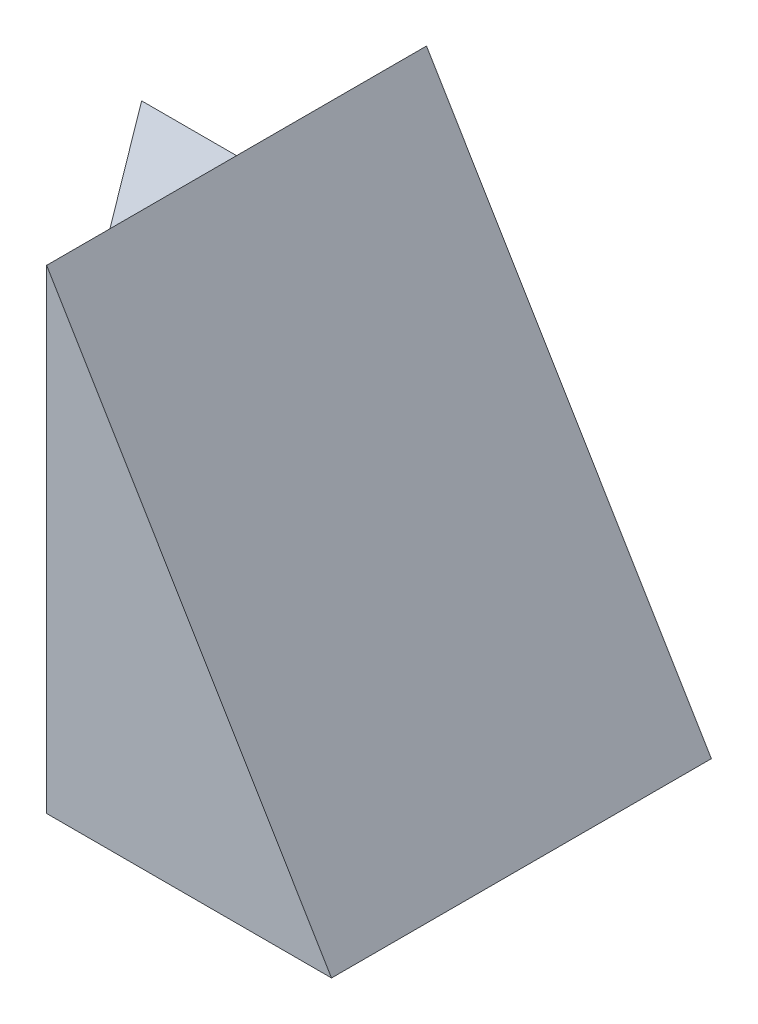
ISO-10303-21;
HEADER;
FILE_DESCRIPTION(('STEP AP214'),'2;1');
FILE_NAME('part.step','',(''),(''),'','','');
FILE_SCHEMA(('AUTOMOTIVE_DESIGN { 1 0 10303 214 1 1 1 1 }'));
ENDSEC;
DATA;
#1=APPLICATION_CONTEXT('core data for automotive mechanical design processes');
#2=APPLICATION_PROTOCOL_DEFINITION('international standard','automotive_design',2000,#1);
#3=PRODUCT_CONTEXT('',#1,'mechanical');
#4=PRODUCT('Part','Part','',(#3));
#5=PRODUCT_RELATED_PRODUCT_CATEGORY('part','',(#4));
#6=PRODUCT_DEFINITION_FORMATION('','',#4);
#7=PRODUCT_DEFINITION_CONTEXT('part definition',#1,'design');
#8=PRODUCT_DEFINITION('design','',#6,#7);
#9=PRODUCT_DEFINITION_SHAPE('','',#8);
#10=(LENGTH_UNIT() NAMED_UNIT(*) SI_UNIT(.MILLI.,.METRE.));
#11=(NAMED_UNIT(*) PLANE_ANGLE_UNIT() SI_UNIT($,.RADIAN.));
#12=(NAMED_UNIT(*) SI_UNIT($,.STERADIAN.) SOLID_ANGLE_UNIT());
#13=UNCERTAINTY_MEASURE_WITH_UNIT(LENGTH_MEASURE(1.E-05),#10,'distance_accuracy_value','');
#14=(GEOMETRIC_REPRESENTATION_CONTEXT(3) GLOBAL_UNCERTAINTY_ASSIGNED_CONTEXT((#13)) GLOBAL_UNIT_ASSIGNED_CONTEXT((#10,
#11,#12)) REPRESENTATION_CONTEXT('',''));
#15=CARTESIAN_POINT('',(0.,0.,0.));
#16=DIRECTION('',(0.,0.,1.));
#17=DIRECTION('',(1.,0.,0.));
#18=AXIS2_PLACEMENT_3D('',#15,#16,#17);
#19=CARTESIAN_POINT('',(-3.,3.,-4.));
#20=DIRECTION('',(0.,0.,1.));
#21=DIRECTION('',(1.,0.,0.));
#22=AXIS2_PLACEMENT_3D('',#19,#20,#21);
#23=PLANE('',#22);
#24=DIRECTION('',(-1.,0.,0.));
#25=VECTOR('',#24,1.);
#26=CARTESIAN_POINT('',(-3.,0.,-4.));
#27=LINE('',#26,#25);
#28=CARTESIAN_POINT('',(3.,0.,-4.));
#29=VERTEX_POINT('',#28);
#30=CARTESIAN_POINT('',(-3.,0.,-4.));
#31=VERTEX_POINT('',#30);
#32=EDGE_CURVE('E85',#29,#31,#27,.T.);
#33=ORIENTED_EDGE('',*,*,#32,.T.);
#34=DIRECTION('',(0.,-1.,0.));
#35=VECTOR('',#34,1.);
#36=CARTESIAN_POINT('',(-3.,3.,-4.));
#37=LINE('',#36,#35);
#38=CARTESIAN_POINT('',(-3.,3.,-4.));
#39=VERTEX_POINT('',#38);
#40=EDGE_CURVE('E11',#39,#31,#37,.T.);
#41=ORIENTED_EDGE('',*,*,#40,.F.);
#42=DIRECTION('',(-1.,0.,0.));
#43=VECTOR('',#42,1.);
#44=CARTESIAN_POINT('',(-3.,3.,-4.));
#45=LINE('',#44,#43);
#46=CARTESIAN_POINT('',(0.,3.,-4.));
#47=VERTEX_POINT('',#46);
#48=EDGE_CURVE('E52',#47,#39,#45,.T.);
#49=ORIENTED_EDGE('',*,*,#48,.F.);
#50=DIRECTION('',(0.,-1.,0.));
#51=VECTOR('',#50,1.);
#52=CARTESIAN_POINT('',(0.,0.,-4.));
#53=LINE('',#52,#51);
#54=CARTESIAN_POINT('',(0.,5.,-4.));
#55=VERTEX_POINT('',#54);
#56=EDGE_CURVE('E99',#55,#47,#53,.T.);
#57=ORIENTED_EDGE('',*,*,#56,.F.);
#58=DIRECTION('',(-0.514495755427526,0.857492925712544,0.));
#59=VECTOR('',#58,1.);
#60=CARTESIAN_POINT('',(2.20588235294118,1.32352941176471,-4.));
#61=LINE('',#60,#59);
#62=EDGE_CURVE('E108',#29,#55,#61,.T.);
#63=ORIENTED_EDGE('',*,*,#62,.F.);
#64=EDGE_LOOP('',(#33,#41,#49,#57,#63));
#65=FACE_BOUND('',#64,.T.);
#66=ADVANCED_FACE('F35',(#65),#23,.F.);
#67=CARTESIAN_POINT('',(0.,3.,0.));
#68=DIRECTION('',(0.8,0.,-0.6));
#69=DIRECTION('',(-0.6,0.,-0.8));
#70=AXIS2_PLACEMENT_3D('',#67,#68,#69);
#71=PLANE('',#70);
#72=DIRECTION('',(0.6,0.,0.8));
#73=VECTOR('',#72,1.);
#74=CARTESIAN_POINT('',(0.,0.,0.));
#75=LINE('',#74,#73);
#76=CARTESIAN_POINT('',(0.,0.,0.));
#77=VERTEX_POINT('',#76);
#78=EDGE_CURVE('E119',#31,#77,#75,.T.);
#79=ORIENTED_EDGE('',*,*,#78,.T.);
#80=DIRECTION('',(0.,-1.,0.));
#81=VECTOR('',#80,1.);
#82=CARTESIAN_POINT('',(0.,3.,0.));
#83=LINE('',#82,#81);
#84=CARTESIAN_POINT('',(0.,3.,0.));
#85=VERTEX_POINT('',#84);
#86=EDGE_CURVE('E44',#85,#77,#83,.T.);
#87=ORIENTED_EDGE('',*,*,#86,.F.);
#88=DIRECTION('',(0.6,0.,0.8));
#89=VECTOR('',#88,1.);
#90=CARTESIAN_POINT('',(0.,3.,0.));
#91=LINE('',#90,#89);
#92=EDGE_CURVE('E122',#39,#85,#91,.T.);
#93=ORIENTED_EDGE('',*,*,#92,.F.);
#94=ORIENTED_EDGE('',*,*,#40,.T.);
#95=EDGE_LOOP('',(#79,#87,#93,#94));
#96=FACE_BOUND('',#95,.T.);
#97=ADVANCED_FACE('F134',(#96),#71,.F.);
#98=CARTESIAN_POINT('',(0.,3.,0.));
#99=DIRECTION('',(0.,1.,0.));
#100=DIRECTION('',(0.,0.,1.));
#101=AXIS2_PLACEMENT_3D('',#98,#99,#100);
#102=PLANE('',#101);
#103=DIRECTION('',(0.,0.,-1.));
#104=VECTOR('',#103,1.);
#105=CARTESIAN_POINT('',(0.,3.,-4.));
#106=LINE('',#105,#104);
#107=EDGE_CURVE('E116',#85,#47,#106,.T.);
#108=ORIENTED_EDGE('',*,*,#107,.T.);
#109=ORIENTED_EDGE('',*,*,#48,.T.);
#110=ORIENTED_EDGE('',*,*,#92,.T.);
#111=EDGE_LOOP('',(#108,#109,#110));
#112=FACE_BOUND('',#111,.T.);
#113=ADVANCED_FACE('F132',(#112),#102,.T.);
#114=CARTESIAN_POINT('',(0.,0.,0.));
#115=DIRECTION('',(0.,1.,0.));
#116=DIRECTION('',(0.,0.,1.));
#117=AXIS2_PLACEMENT_3D('',#114,#115,#116);
#118=PLANE('',#117);
#119=ORIENTED_EDGE('',*,*,#32,.F.);
#120=DIRECTION('',(0.,0.,-1.));
#121=VECTOR('',#120,1.);
#122=CARTESIAN_POINT('',(3.,0.,0.));
#123=LINE('',#122,#121);
#124=CARTESIAN_POINT('',(3.,0.,0.));
#125=VERTEX_POINT('',#124);
#126=EDGE_CURVE('E77',#125,#29,#123,.T.);
#127=ORIENTED_EDGE('',*,*,#126,.F.);
#128=DIRECTION('',(-1.,0.,0.));
#129=VECTOR('',#128,1.);
#130=CARTESIAN_POINT('',(0.,0.,0.));
#131=LINE('',#130,#129);
#132=EDGE_CURVE('E82',#125,#77,#131,.T.);
#133=ORIENTED_EDGE('',*,*,#132,.T.);
#134=ORIENTED_EDGE('',*,*,#78,.F.);
#135=EDGE_LOOP('',(#119,#127,#133,#134));
#136=FACE_BOUND('',#135,.T.);
#137=ADVANCED_FACE('F79',(#136),#118,.F.);
#138=CARTESIAN_POINT('',(2.20588235294118,1.32352941176471,0.));
#139=DIRECTION('',(-0.857492925712544,-0.514495755427526,0.));
#140=DIRECTION('',(0.514495755427526,-0.857492925712544,0.));
#141=AXIS2_PLACEMENT_3D('',#138,#139,#140);
#142=PLANE('',#141);
#143=ORIENTED_EDGE('',*,*,#62,.T.);
#144=DIRECTION('',(0.,0.,-1.));
#145=VECTOR('',#144,1.);
#146=CARTESIAN_POINT('',(0.,5.,0.));
#147=LINE('',#146,#145);
#148=CARTESIAN_POINT('',(0.,5.,0.));
#149=VERTEX_POINT('',#148);
#150=EDGE_CURVE('E89',#149,#55,#147,.T.);
#151=ORIENTED_EDGE('',*,*,#150,.F.);
#152=DIRECTION('',(-0.514495755427526,0.857492925712544,0.));
#153=VECTOR('',#152,1.);
#154=CARTESIAN_POINT('',(2.20588235294118,1.32352941176471,0.));
#155=LINE('',#154,#153);
#156=EDGE_CURVE('E94',#125,#149,#155,.T.);
#157=ORIENTED_EDGE('',*,*,#156,.F.);
#158=ORIENTED_EDGE('',*,*,#126,.T.);
#159=EDGE_LOOP('',(#143,#151,#157,#158));
#160=FACE_BOUND('',#159,.T.);
#161=ADVANCED_FACE('F95',(#160),#142,.F.);
#162=CARTESIAN_POINT('',(0.,0.,0.));
#163=DIRECTION('',(1.,0.,0.));
#164=DIRECTION('',(0.,0.,-1.));
#165=AXIS2_PLACEMENT_3D('',#162,#163,#164);
#166=PLANE('',#165);
#167=ORIENTED_EDGE('',*,*,#107,.F.);
#168=DIRECTION('',(0.,-1.,0.));
#169=VECTOR('',#168,1.);
#170=CARTESIAN_POINT('',(0.,0.,0.));
#171=LINE('',#170,#169);
#172=EDGE_CURVE('E90',#149,#85,#171,.T.);
#173=ORIENTED_EDGE('',*,*,#172,.F.);
#174=ORIENTED_EDGE('',*,*,#150,.T.);
#175=ORIENTED_EDGE('',*,*,#56,.T.);
#176=EDGE_LOOP('',(#167,#173,#174,#175));
#177=FACE_BOUND('',#176,.T.);
#178=ADVANCED_FACE('F131',(#177),#166,.F.);
#179=CARTESIAN_POINT('',(0.,0.,0.));
#180=DIRECTION('',(0.,0.,-1.));
#181=DIRECTION('',(-1.,0.,0.));
#182=AXIS2_PLACEMENT_3D('',#179,#180,#181);
#183=PLANE('',#182);
#184=ORIENTED_EDGE('',*,*,#156,.T.);
#185=ORIENTED_EDGE('',*,*,#172,.T.);
#186=ORIENTED_EDGE('',*,*,#86,.T.);
#187=ORIENTED_EDGE('',*,*,#132,.F.);
#188=EDGE_LOOP('',(#184,#185,#186,#187));
#189=FACE_BOUND('',#188,.T.);
#190=ADVANCED_FACE('F101',(#189),#183,.F.);
#191=CLOSED_SHELL('',(#66,#97,#113,#137,#161,#178,#190));
#192=MANIFOLD_SOLID_BREP('B2',#191);
#193=ADVANCED_BREP_SHAPE_REPRESENTATION('',(#18,#192),#14);
#194=SHAPE_DEFINITION_REPRESENTATION(#9,#193);
ENDSEC;
END-ISO-10303-21;
